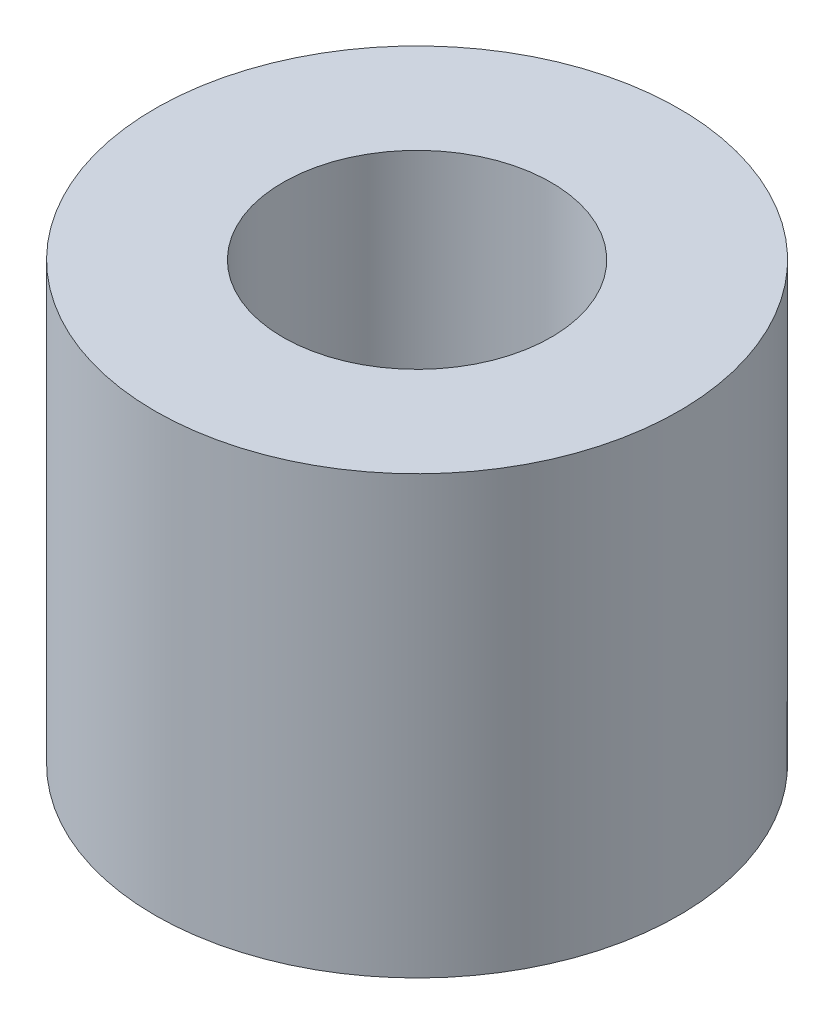
ISO-10303-21;
HEADER;
FILE_DESCRIPTION(('STEP AP214'),'2;1');
FILE_NAME('part.step','',(''),(''),'','','');
FILE_SCHEMA(('AUTOMOTIVE_DESIGN { 1 0 10303 214 1 1 1 1 }'));
ENDSEC;
DATA;
#1=APPLICATION_CONTEXT('core data for automotive mechanical design processes');
#2=APPLICATION_PROTOCOL_DEFINITION('international standard','automotive_design',2000,#1);
#3=PRODUCT_CONTEXT('',#1,'mechanical');
#4=PRODUCT('Part','Part','',(#3));
#5=PRODUCT_RELATED_PRODUCT_CATEGORY('part','',(#4));
#6=PRODUCT_DEFINITION_FORMATION('','',#4);
#7=PRODUCT_DEFINITION_CONTEXT('part definition',#1,'design');
#8=PRODUCT_DEFINITION('design','',#6,#7);
#9=PRODUCT_DEFINITION_SHAPE('','',#8);
#10=(LENGTH_UNIT() NAMED_UNIT(*) SI_UNIT(.MILLI.,.METRE.));
#11=(NAMED_UNIT(*) PLANE_ANGLE_UNIT() SI_UNIT($,.RADIAN.));
#12=(NAMED_UNIT(*) SI_UNIT($,.STERADIAN.) SOLID_ANGLE_UNIT());
#13=UNCERTAINTY_MEASURE_WITH_UNIT(LENGTH_MEASURE(1.E-05),#10,'distance_accuracy_value','');
#14=(GEOMETRIC_REPRESENTATION_CONTEXT(3) GLOBAL_UNCERTAINTY_ASSIGNED_CONTEXT((#13)) GLOBAL_UNIT_ASSIGNED_CONTEXT((#10,
#11,#12)) REPRESENTATION_CONTEXT('',''));
#15=CARTESIAN_POINT('',(0.,0.,0.));
#16=DIRECTION('',(0.,0.,1.));
#17=DIRECTION('',(1.,0.,0.));
#18=AXIS2_PLACEMENT_3D('',#15,#16,#17);
#19=CARTESIAN_POINT('',(0.,0.,0.));
#20=DIRECTION('',(0.,1.,0.));
#21=DIRECTION('',(0.,0.,1.));
#22=AXIS2_PLACEMENT_3D('',#19,#20,#21);
#23=CYLINDRICAL_SURFACE('',#22,2.4384);
#24=CARTESIAN_POINT('',(0.,7.9375,0.));
#25=DIRECTION('',(0.,1.,0.));
#26=DIRECTION('',(0.,0.,1.));
#27=AXIS2_PLACEMENT_3D('',#24,#25,#26);
#28=CIRCLE('',#27,2.4384);
#29=CARTESIAN_POINT('',(0.,7.9375,2.4384));
#30=VERTEX_POINT('',#29);
#31=EDGE_CURVE('E18',#30,#30,#28,.F.);
#32=ORIENTED_EDGE('',*,*,#31,.F.);
#33=EDGE_LOOP('',(#32));
#34=FACE_BOUND('',#33,.T.);
#35=CARTESIAN_POINT('',(0.,0.,0.));
#36=DIRECTION('',(0.,1.,0.));
#37=DIRECTION('',(0.,0.,1.));
#38=AXIS2_PLACEMENT_3D('',#35,#36,#37);
#39=CIRCLE('',#38,2.4384);
#40=CARTESIAN_POINT('',(0.,0.,2.4384));
#41=VERTEX_POINT('',#40);
#42=EDGE_CURVE('E31',#41,#41,#39,.F.);
#43=ORIENTED_EDGE('',*,*,#42,.T.);
#44=EDGE_LOOP('',(#43));
#45=FACE_BOUND('',#44,.T.);
#46=ADVANCED_FACE('F15',(#34,#45),#23,.F.);
#47=CARTESIAN_POINT('',(0.,7.9375,0.));
#48=DIRECTION('',(0.,1.,0.));
#49=DIRECTION('',(0.,0.,1.));
#50=AXIS2_PLACEMENT_3D('',#47,#48,#49);
#51=PLANE('',#50);
#52=ORIENTED_EDGE('',*,*,#31,.T.);
#53=EDGE_LOOP('',(#52));
#54=FACE_BOUND('',#53,.T.);
#55=CARTESIAN_POINT('',(0.,7.9375,0.));
#56=DIRECTION('',(0.,1.,0.));
#57=DIRECTION('',(0.,0.,1.));
#58=AXIS2_PLACEMENT_3D('',#55,#56,#57);
#59=CIRCLE('',#58,4.7625);
#60=CARTESIAN_POINT('',(0.,7.9375,4.7625));
#61=VERTEX_POINT('',#60);
#62=EDGE_CURVE('E23',#61,#61,#59,.F.);
#63=ORIENTED_EDGE('',*,*,#62,.F.);
#64=EDGE_LOOP('',(#63));
#65=FACE_BOUND('',#64,.T.);
#66=ADVANCED_FACE('F40',(#54,#65),#51,.T.);
#67=CARTESIAN_POINT('',(0.,0.,0.));
#68=DIRECTION('',(0.,1.,0.));
#69=DIRECTION('',(0.,0.,1.));
#70=AXIS2_PLACEMENT_3D('',#67,#68,#69);
#71=PLANE('',#70);
#72=ORIENTED_EDGE('',*,*,#42,.F.);
#73=EDGE_LOOP('',(#72));
#74=FACE_BOUND('',#73,.T.);
#75=CARTESIAN_POINT('',(0.,0.,0.));
#76=DIRECTION('',(0.,1.,0.));
#77=DIRECTION('',(0.,0.,1.));
#78=AXIS2_PLACEMENT_3D('',#75,#76,#77);
#79=CIRCLE('',#78,4.7625);
#80=CARTESIAN_POINT('',(0.,0.,4.7625));
#81=VERTEX_POINT('',#80);
#82=EDGE_CURVE('E10',#81,#81,#79,.T.);
#83=ORIENTED_EDGE('',*,*,#82,.F.);
#84=EDGE_LOOP('',(#83));
#85=FACE_BOUND('',#84,.T.);
#86=ADVANCED_FACE('F48',(#74,#85),#71,.F.);
#87=CARTESIAN_POINT('',(0.,0.,0.));
#88=DIRECTION('',(0.,1.,0.));
#89=DIRECTION('',(0.,0.,1.));
#90=AXIS2_PLACEMENT_3D('',#87,#88,#89);
#91=CYLINDRICAL_SURFACE('',#90,4.7625);
#92=ORIENTED_EDGE('',*,*,#62,.T.);
#93=EDGE_LOOP('',(#92));
#94=FACE_BOUND('',#93,.T.);
#95=ORIENTED_EDGE('',*,*,#82,.T.);
#96=EDGE_LOOP('',(#95));
#97=FACE_BOUND('',#96,.T.);
#98=ADVANCED_FACE('F49',(#94,#97),#91,.T.);
#99=CLOSED_SHELL('',(#46,#66,#86,#98));
#100=MANIFOLD_SOLID_BREP('B1',#99);
#101=ADVANCED_BREP_SHAPE_REPRESENTATION('',(#18,#100),#14);
#102=SHAPE_DEFINITION_REPRESENTATION(#9,#101);
ENDSEC;
END-ISO-10303-21;
